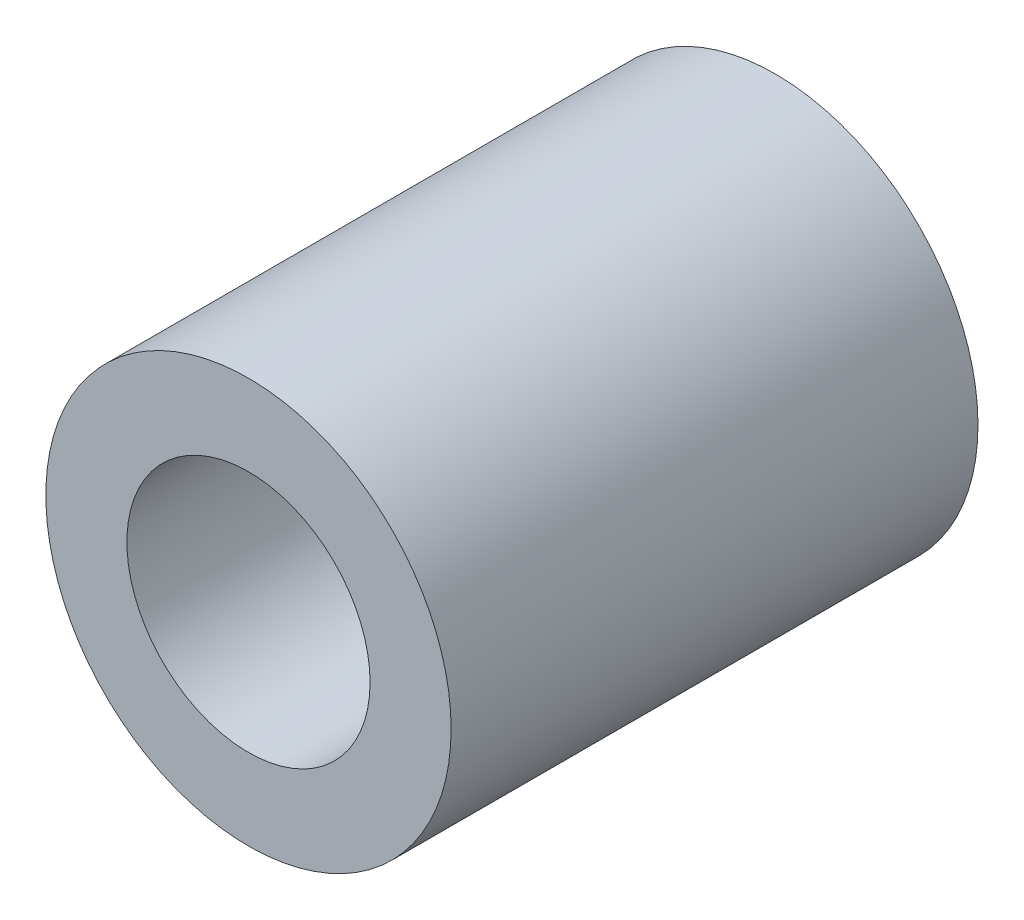
ISO-10303-21;
HEADER;
FILE_DESCRIPTION(('STEP AP214'),'2;1');
FILE_NAME('part.step','',(''),(''),'','','');
FILE_SCHEMA(('AUTOMOTIVE_DESIGN { 1 0 10303 214 1 1 1 1 }'));
ENDSEC;
DATA;
#1=APPLICATION_CONTEXT('core data for automotive mechanical design processes');
#2=APPLICATION_PROTOCOL_DEFINITION('international standard','automotive_design',2000,#1);
#3=PRODUCT_CONTEXT('',#1,'mechanical');
#4=PRODUCT('Part','Part','',(#3));
#5=PRODUCT_RELATED_PRODUCT_CATEGORY('part','',(#4));
#6=PRODUCT_DEFINITION_FORMATION('','',#4);
#7=PRODUCT_DEFINITION_CONTEXT('part definition',#1,'design');
#8=PRODUCT_DEFINITION('design','',#6,#7);
#9=PRODUCT_DEFINITION_SHAPE('','',#8);
#10=(LENGTH_UNIT() NAMED_UNIT(*) SI_UNIT(.MILLI.,.METRE.));
#11=(NAMED_UNIT(*) PLANE_ANGLE_UNIT() SI_UNIT($,.RADIAN.));
#12=(NAMED_UNIT(*) SI_UNIT($,.STERADIAN.) SOLID_ANGLE_UNIT());
#13=UNCERTAINTY_MEASURE_WITH_UNIT(LENGTH_MEASURE(1.E-05),#10,'distance_accuracy_value','');
#14=(GEOMETRIC_REPRESENTATION_CONTEXT(3) GLOBAL_UNCERTAINTY_ASSIGNED_CONTEXT((#13)) GLOBAL_UNIT_ASSIGNED_CONTEXT((#10,
#11,#12)) REPRESENTATION_CONTEXT('',''));
#15=CARTESIAN_POINT('',(0.,0.,0.));
#16=DIRECTION('',(0.,0.,1.));
#17=DIRECTION('',(1.,0.,0.));
#18=AXIS2_PLACEMENT_3D('',#15,#16,#17);
#19=CARTESIAN_POINT('',(0.,0.,13.));
#20=DIRECTION('',(0.,0.,1.));
#21=DIRECTION('',(1.,0.,0.));
#22=AXIS2_PLACEMENT_3D('',#19,#20,#21);
#23=PLANE('',#22);
#24=CARTESIAN_POINT('',(0.,0.,13.));
#25=DIRECTION('',(0.,0.,1.));
#26=DIRECTION('',(1.,0.,0.));
#27=AXIS2_PLACEMENT_3D('',#24,#25,#26);
#28=CIRCLE('',#27,5.);
#29=CARTESIAN_POINT('',(5.,0.,13.));
#30=VERTEX_POINT('',#29);
#31=EDGE_CURVE('E10',#30,#30,#28,.T.);
#32=ORIENTED_EDGE('',*,*,#31,.T.);
#33=EDGE_LOOP('',(#32));
#34=FACE_BOUND('',#33,.T.);
#35=CARTESIAN_POINT('',(0.,0.,13.));
#36=DIRECTION('',(0.,0.,1.));
#37=DIRECTION('',(1.,0.,0.));
#38=AXIS2_PLACEMENT_3D('',#35,#36,#37);
#39=CIRCLE('',#38,3.);
#40=CARTESIAN_POINT('',(3.,0.,13.));
#41=VERTEX_POINT('',#40);
#42=EDGE_CURVE('E40',#41,#41,#39,.T.);
#43=ORIENTED_EDGE('',*,*,#42,.F.);
#44=EDGE_LOOP('',(#43));
#45=FACE_BOUND('',#44,.T.);
#46=ADVANCED_FACE('F29',(#34,#45),#23,.T.);
#47=CARTESIAN_POINT('',(0.,0.,0.));
#48=DIRECTION('',(0.,0.,1.));
#49=DIRECTION('',(1.,0.,0.));
#50=AXIS2_PLACEMENT_3D('',#47,#48,#49);
#51=PLANE('',#50);
#52=CARTESIAN_POINT('',(0.,0.,0.));
#53=DIRECTION('',(0.,0.,1.));
#54=DIRECTION('',(1.,0.,0.));
#55=AXIS2_PLACEMENT_3D('',#52,#53,#54);
#56=CIRCLE('',#55,5.);
#57=CARTESIAN_POINT('',(5.,0.,0.));
#58=VERTEX_POINT('',#57);
#59=EDGE_CURVE('E33',#58,#58,#56,.T.);
#60=ORIENTED_EDGE('',*,*,#59,.F.);
#61=EDGE_LOOP('',(#60));
#62=FACE_BOUND('',#61,.T.);
#63=CARTESIAN_POINT('',(0.,0.,0.));
#64=DIRECTION('',(0.,0.,1.));
#65=DIRECTION('',(1.,0.,0.));
#66=AXIS2_PLACEMENT_3D('',#63,#64,#65);
#67=CIRCLE('',#66,3.);
#68=CARTESIAN_POINT('',(3.,0.,0.));
#69=VERTEX_POINT('',#68);
#70=EDGE_CURVE('E42',#69,#69,#67,.T.);
#71=ORIENTED_EDGE('',*,*,#70,.T.);
#72=EDGE_LOOP('',(#71));
#73=FACE_BOUND('',#72,.T.);
#74=ADVANCED_FACE('F52',(#62,#73),#51,.F.);
#75=CARTESIAN_POINT('',(0.,0.,13.));
#76=DIRECTION('',(0.,0.,-1.));
#77=DIRECTION('',(-1.,0.,0.));
#78=AXIS2_PLACEMENT_3D('',#75,#76,#77);
#79=CYLINDRICAL_SURFACE('',#78,5.);
#80=ORIENTED_EDGE('',*,*,#31,.F.);
#81=EDGE_LOOP('',(#80));
#82=FACE_BOUND('',#81,.T.);
#83=ORIENTED_EDGE('',*,*,#59,.T.);
#84=EDGE_LOOP('',(#83));
#85=FACE_BOUND('',#84,.T.);
#86=ADVANCED_FACE('F31',(#82,#85),#79,.T.);
#87=CARTESIAN_POINT('',(0.,0.,13.));
#88=DIRECTION('',(0.,0.,-1.));
#89=DIRECTION('',(-1.,0.,0.));
#90=AXIS2_PLACEMENT_3D('',#87,#88,#89);
#91=CYLINDRICAL_SURFACE('',#90,3.);
#92=ORIENTED_EDGE('',*,*,#42,.T.);
#93=EDGE_LOOP('',(#92));
#94=FACE_BOUND('',#93,.T.);
#95=ORIENTED_EDGE('',*,*,#70,.F.);
#96=EDGE_LOOP('',(#95));
#97=FACE_BOUND('',#96,.T.);
#98=ADVANCED_FACE('F48',(#94,#97),#91,.F.);
#99=CLOSED_SHELL('',(#46,#74,#86,#98));
#100=MANIFOLD_SOLID_BREP('B2',#99);
#101=ADVANCED_BREP_SHAPE_REPRESENTATION('',(#18,#100),#14);
#102=SHAPE_DEFINITION_REPRESENTATION(#9,#101);
ENDSEC;
END-ISO-10303-21;
